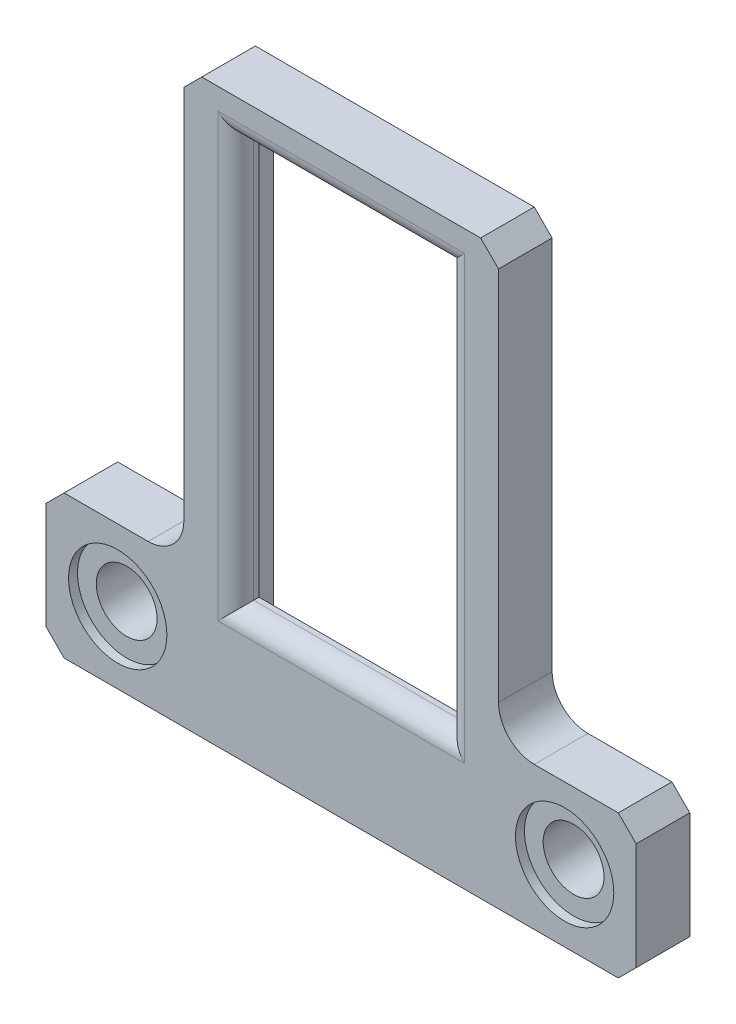
ISO-10303-21;
HEADER;
FILE_DESCRIPTION(('STEP AP214'),'2;1');
FILE_NAME('part.step','',(''),(''),'','','');
FILE_SCHEMA(('AUTOMOTIVE_DESIGN { 1 0 10303 214 1 1 1 1 }'));
ENDSEC;
DATA;
#1=APPLICATION_CONTEXT('core data for automotive mechanical design processes');
#2=APPLICATION_PROTOCOL_DEFINITION('international standard','automotive_design',2000,#1);
#3=PRODUCT_CONTEXT('',#1,'mechanical');
#4=PRODUCT('Part','Part','',(#3));
#5=PRODUCT_RELATED_PRODUCT_CATEGORY('part','',(#4));
#6=PRODUCT_DEFINITION_FORMATION('','',#4);
#7=PRODUCT_DEFINITION_CONTEXT('part definition',#1,'design');
#8=PRODUCT_DEFINITION('design','',#6,#7);
#9=PRODUCT_DEFINITION_SHAPE('','',#8);
#10=(LENGTH_UNIT() NAMED_UNIT(*) SI_UNIT(.MILLI.,.METRE.));
#11=(NAMED_UNIT(*) PLANE_ANGLE_UNIT() SI_UNIT($,.RADIAN.));
#12=(NAMED_UNIT(*) SI_UNIT($,.STERADIAN.) SOLID_ANGLE_UNIT());
#13=UNCERTAINTY_MEASURE_WITH_UNIT(LENGTH_MEASURE(1.E-05),#10,'distance_accuracy_value','');
#14=(GEOMETRIC_REPRESENTATION_CONTEXT(3) GLOBAL_UNCERTAINTY_ASSIGNED_CONTEXT((#13)) GLOBAL_UNIT_ASSIGNED_CONTEXT((#10,
#11,#12)) REPRESENTATION_CONTEXT('',''));
#15=CARTESIAN_POINT('',(0.,0.,0.));
#16=DIRECTION('',(0.,0.,1.));
#17=DIRECTION('',(1.,0.,0.));
#18=AXIS2_PLACEMENT_3D('',#15,#16,#17);
#19=CARTESIAN_POINT('',(0.,0.,3.));
#20=DIRECTION('',(1.,0.,0.));
#21=DIRECTION('',(0.,1.,0.));
#22=AXIS2_PLACEMENT_3D('',#19,#20,#21);
#23=PLANE('',#22);
#24=DIRECTION('',(0.,-1.,0.));
#25=VECTOR('',#24,1.);
#26=CARTESIAN_POINT('',(0.,0.,0.));
#27=LINE('',#26,#25);
#28=CARTESIAN_POINT('',(0.,-1.00000000000001,0.));
#29=VERTEX_POINT('',#28);
#30=CARTESIAN_POINT('',(0.,-22.,0.));
#31=VERTEX_POINT('',#30);
#32=EDGE_CURVE('E399',#29,#31,#27,.T.);
#33=ORIENTED_EDGE('',*,*,#32,.T.);
#34=DIRECTION('',(0.,0.,-1.));
#35=VECTOR('',#34,1.);
#36=CARTESIAN_POINT('',(0.,-22.,3.));
#37=LINE('',#36,#35);
#38=CARTESIAN_POINT('',(0.,-22.,3.));
#39=VERTEX_POINT('',#38);
#40=EDGE_CURVE('E315',#31,#39,#37,.F.);
#41=ORIENTED_EDGE('',*,*,#40,.T.);
#42=DIRECTION('',(0.,-1.,0.));
#43=VECTOR('',#42,1.);
#44=CARTESIAN_POINT('',(0.,0.,3.));
#45=LINE('',#44,#43);
#46=CARTESIAN_POINT('',(0.,-1.00000000000001,3.));
#47=VERTEX_POINT('',#46);
#48=EDGE_CURVE('E406',#47,#39,#45,.T.);
#49=ORIENTED_EDGE('',*,*,#48,.F.);
#50=DIRECTION('',(0.,0.,-1.));
#51=VECTOR('',#50,1.);
#52=CARTESIAN_POINT('',(0.,-1.00000000000001,3.));
#53=LINE('',#52,#51);
#54=EDGE_CURVE('E304',#47,#29,#53,.T.);
#55=ORIENTED_EDGE('',*,*,#54,.T.);
#56=EDGE_LOOP('',(#33,#41,#49,#55));
#57=FACE_BOUND('',#56,.T.);
#58=ADVANCED_FACE('F37',(#57),#23,.F.);
#59=CARTESIAN_POINT('',(0.,-24.,3.));
#60=DIRECTION('',(0.,-1.,0.));
#61=DIRECTION('',(0.,0.,-1.));
#62=AXIS2_PLACEMENT_3D('',#59,#60,#61);
#63=PLANE('',#62);
#64=DIRECTION('',(-1.,0.,0.));
#65=VECTOR('',#64,1.);
#66=CARTESIAN_POINT('',(0.,-24.,3.));
#67=LINE('',#66,#65);
#68=CARTESIAN_POINT('',(-2.,-24.,3.));
#69=VERTEX_POINT('',#68);
#70=CARTESIAN_POINT('',(-6.69999999999999,-24.,3.));
#71=VERTEX_POINT('',#70);
#72=EDGE_CURVE('E409',#69,#71,#67,.T.);
#73=ORIENTED_EDGE('',*,*,#72,.F.);
#74=DIRECTION('',(0.,0.,-1.));
#75=VECTOR('',#74,1.);
#76=CARTESIAN_POINT('',(-2.,-24.,0.));
#77=LINE('',#76,#75);
#78=CARTESIAN_POINT('',(-2.,-24.,0.));
#79=VERTEX_POINT('',#78);
#80=EDGE_CURVE('E312',#69,#79,#77,.T.);
#81=ORIENTED_EDGE('',*,*,#80,.T.);
#82=DIRECTION('',(-1.,0.,0.));
#83=VECTOR('',#82,1.);
#84=CARTESIAN_POINT('',(0.,-24.,0.));
#85=LINE('',#84,#83);
#86=CARTESIAN_POINT('',(-6.69999999999999,-24.,0.));
#87=VERTEX_POINT('',#86);
#88=EDGE_CURVE('E430',#79,#87,#85,.T.);
#89=ORIENTED_EDGE('',*,*,#88,.T.);
#90=DIRECTION('',(0.,0.,1.));
#91=VECTOR('',#90,1.);
#92=CARTESIAN_POINT('',(-6.69999999999999,-24.,3.));
#93=LINE('',#92,#91);
#94=EDGE_CURVE('E268',#87,#71,#93,.T.);
#95=ORIENTED_EDGE('',*,*,#94,.T.);
#96=EDGE_LOOP('',(#73,#81,#89,#95));
#97=FACE_BOUND('',#96,.T.);
#98=ADVANCED_FACE('F466',(#97),#63,.F.);
#99=CARTESIAN_POINT('',(-7.69999999999999,-32.,3.));
#100=DIRECTION('',(1.,0.,0.));
#101=DIRECTION('',(0.,0.,-1.));
#102=AXIS2_PLACEMENT_3D('',#99,#100,#101);
#103=PLANE('',#102);
#104=DIRECTION('',(0.,-1.,0.));
#105=VECTOR('',#104,1.);
#106=CARTESIAN_POINT('',(-7.69999999999999,-32.,3.));
#107=LINE('',#106,#105);
#108=CARTESIAN_POINT('',(-7.69999999999999,-25.,3.));
#109=VERTEX_POINT('',#108);
#110=CARTESIAN_POINT('',(-7.69999999999999,-31.,3.));
#111=VERTEX_POINT('',#110);
#112=EDGE_CURVE('E412',#109,#111,#107,.T.);
#113=ORIENTED_EDGE('',*,*,#112,.F.);
#114=DIRECTION('',(0.,0.,-1.));
#115=VECTOR('',#114,1.);
#116=CARTESIAN_POINT('',(-7.69999999999999,-25.,3.));
#117=LINE('',#116,#115);
#118=CARTESIAN_POINT('',(-7.69999999999999,-25.,0.));
#119=VERTEX_POINT('',#118);
#120=EDGE_CURVE('E239',#109,#119,#117,.T.);
#121=ORIENTED_EDGE('',*,*,#120,.T.);
#122=DIRECTION('',(0.,-1.,0.));
#123=VECTOR('',#122,1.);
#124=CARTESIAN_POINT('',(-7.69999999999999,-32.,0.));
#125=LINE('',#124,#123);
#126=CARTESIAN_POINT('',(-7.69999999999999,-31.,0.));
#127=VERTEX_POINT('',#126);
#128=EDGE_CURVE('E432',#119,#127,#125,.T.);
#129=ORIENTED_EDGE('',*,*,#128,.T.);
#130=DIRECTION('',(0.,0.,1.));
#131=VECTOR('',#130,1.);
#132=CARTESIAN_POINT('',(-7.69999999999999,-31.,3.));
#133=LINE('',#132,#131);
#134=EDGE_CURVE('E237',#127,#111,#133,.T.);
#135=ORIENTED_EDGE('',*,*,#134,.T.);
#136=EDGE_LOOP('',(#113,#121,#129,#135));
#137=FACE_BOUND('',#136,.T.);
#138=ADVANCED_FACE('F472',(#137),#103,.F.);
#139=CARTESIAN_POINT('',(-7.69999999999999,-32.,3.));
#140=DIRECTION('',(0.,1.,0.));
#141=DIRECTION('',(0.,0.,1.));
#142=AXIS2_PLACEMENT_3D('',#139,#140,#141);
#143=PLANE('',#142);
#144=DIRECTION('',(1.,0.,0.));
#145=VECTOR('',#144,1.);
#146=CARTESIAN_POINT('',(-7.69999999999999,-32.,3.));
#147=LINE('',#146,#145);
#148=CARTESIAN_POINT('',(-6.69999999999999,-32.,3.));
#149=VERTEX_POINT('',#148);
#150=CARTESIAN_POINT('',(24.3,-32.,3.));
#151=VERTEX_POINT('',#150);
#152=EDGE_CURVE('E415',#149,#151,#147,.T.);
#153=ORIENTED_EDGE('',*,*,#152,.F.);
#154=DIRECTION('',(0.,0.,-1.));
#155=VECTOR('',#154,1.);
#156=CARTESIAN_POINT('',(-6.69999999999999,-32.,3.));
#157=LINE('',#156,#155);
#158=CARTESIAN_POINT('',(-6.69999999999999,-32.,0.));
#159=VERTEX_POINT('',#158);
#160=EDGE_CURVE('E285',#149,#159,#157,.T.);
#161=ORIENTED_EDGE('',*,*,#160,.T.);
#162=DIRECTION('',(1.,0.,0.));
#163=VECTOR('',#162,1.);
#164=CARTESIAN_POINT('',(-7.69999999999999,-32.,0.));
#165=LINE('',#164,#163);
#166=CARTESIAN_POINT('',(24.3,-32.,0.));
#167=VERTEX_POINT('',#166);
#168=EDGE_CURVE('E435',#159,#167,#165,.T.);
#169=ORIENTED_EDGE('',*,*,#168,.T.);
#170=DIRECTION('',(0.,0.,1.));
#171=VECTOR('',#170,1.);
#172=CARTESIAN_POINT('',(24.3,-32.,3.));
#173=LINE('',#172,#171);
#174=EDGE_CURVE('E283',#167,#151,#173,.T.);
#175=ORIENTED_EDGE('',*,*,#174,.T.);
#176=EDGE_LOOP('',(#153,#161,#169,#175));
#177=FACE_BOUND('',#176,.T.);
#178=ADVANCED_FACE('F550',(#177),#143,.F.);
#179=CARTESIAN_POINT('',(25.3,-32.,3.));
#180=DIRECTION('',(-1.,0.,0.));
#181=DIRECTION('',(0.,0.,1.));
#182=AXIS2_PLACEMENT_3D('',#179,#180,#181);
#183=PLANE('',#182);
#184=DIRECTION('',(0.,1.,0.));
#185=VECTOR('',#184,1.);
#186=CARTESIAN_POINT('',(25.3,-32.,3.));
#187=LINE('',#186,#185);
#188=CARTESIAN_POINT('',(25.3,-31.,3.));
#189=VERTEX_POINT('',#188);
#190=CARTESIAN_POINT('',(25.3,-25.,3.));
#191=VERTEX_POINT('',#190);
#192=EDGE_CURVE('E418',#189,#191,#187,.T.);
#193=ORIENTED_EDGE('',*,*,#192,.F.);
#194=DIRECTION('',(0.,0.,-1.));
#195=VECTOR('',#194,1.);
#196=CARTESIAN_POINT('',(25.3,-31.,3.));
#197=LINE('',#196,#195);
#198=CARTESIAN_POINT('',(25.3,-31.,0.));
#199=VERTEX_POINT('',#198);
#200=EDGE_CURVE('E290',#189,#199,#197,.T.);
#201=ORIENTED_EDGE('',*,*,#200,.T.);
#202=DIRECTION('',(0.,1.,0.));
#203=VECTOR('',#202,1.);
#204=CARTESIAN_POINT('',(25.3,-32.,0.));
#205=LINE('',#204,#203);
#206=CARTESIAN_POINT('',(25.3,-25.,0.));
#207=VERTEX_POINT('',#206);
#208=EDGE_CURVE('E438',#199,#207,#205,.T.);
#209=ORIENTED_EDGE('',*,*,#208,.T.);
#210=DIRECTION('',(0.,0.,1.));
#211=VECTOR('',#210,1.);
#212=CARTESIAN_POINT('',(25.3,-25.,3.));
#213=LINE('',#212,#211);
#214=EDGE_CURVE('E288',#207,#191,#213,.T.);
#215=ORIENTED_EDGE('',*,*,#214,.T.);
#216=EDGE_LOOP('',(#193,#201,#209,#215));
#217=FACE_BOUND('',#216,.T.);
#218=ADVANCED_FACE('F557',(#217),#183,.F.);
#219=CARTESIAN_POINT('',(17.6,-24.,3.));
#220=DIRECTION('',(0.,-1.,0.));
#221=DIRECTION('',(0.,0.,-1.));
#222=AXIS2_PLACEMENT_3D('',#219,#220,#221);
#223=PLANE('',#222);
#224=DIRECTION('',(-1.,0.,0.));
#225=VECTOR('',#224,1.);
#226=CARTESIAN_POINT('',(17.6,-24.,0.));
#227=LINE('',#226,#225);
#228=CARTESIAN_POINT('',(24.3,-24.,0.));
#229=VERTEX_POINT('',#228);
#230=CARTESIAN_POINT('',(19.6,-24.,0.));
#231=VERTEX_POINT('',#230);
#232=EDGE_CURVE('E441',#229,#231,#227,.T.);
#233=ORIENTED_EDGE('',*,*,#232,.T.);
#234=DIRECTION('',(0.,0.,-1.));
#235=VECTOR('',#234,1.);
#236=CARTESIAN_POINT('',(19.6,-24.,3.));
#237=LINE('',#236,#235);
#238=CARTESIAN_POINT('',(19.6,-24.,3.));
#239=VERTEX_POINT('',#238);
#240=EDGE_CURVE('E310',#231,#239,#237,.F.);
#241=ORIENTED_EDGE('',*,*,#240,.T.);
#242=DIRECTION('',(-1.,0.,0.));
#243=VECTOR('',#242,1.);
#244=CARTESIAN_POINT('',(17.6,-24.,3.));
#245=LINE('',#244,#243);
#246=CARTESIAN_POINT('',(24.3,-24.,3.));
#247=VERTEX_POINT('',#246);
#248=EDGE_CURVE('E421',#247,#239,#245,.T.);
#249=ORIENTED_EDGE('',*,*,#248,.F.);
#250=DIRECTION('',(0.,0.,-1.));
#251=VECTOR('',#250,1.);
#252=CARTESIAN_POINT('',(24.3,-24.,3.));
#253=LINE('',#252,#251);
#254=EDGE_CURVE('E293',#247,#229,#253,.T.);
#255=ORIENTED_EDGE('',*,*,#254,.T.);
#256=EDGE_LOOP('',(#233,#241,#249,#255));
#257=FACE_BOUND('',#256,.T.);
#258=ADVANCED_FACE('F564',(#257),#223,.F.);
#259=CARTESIAN_POINT('',(17.6,0.,3.));
#260=DIRECTION('',(-1.,0.,0.));
#261=DIRECTION('',(0.,-1.,0.));
#262=AXIS2_PLACEMENT_3D('',#259,#260,#261);
#263=PLANE('',#262);
#264=DIRECTION('',(0.,1.,0.));
#265=VECTOR('',#264,1.);
#266=CARTESIAN_POINT('',(17.6,0.,3.));
#267=LINE('',#266,#265);
#268=CARTESIAN_POINT('',(17.6,-22.,3.));
#269=VERTEX_POINT('',#268);
#270=CARTESIAN_POINT('',(17.6,-1.00000000000001,3.));
#271=VERTEX_POINT('',#270);
#272=EDGE_CURVE('E424',#269,#271,#267,.T.);
#273=ORIENTED_EDGE('',*,*,#272,.F.);
#274=DIRECTION('',(0.,0.,-1.));
#275=VECTOR('',#274,1.);
#276=CARTESIAN_POINT('',(17.6,-22.,0.));
#277=LINE('',#276,#275);
#278=CARTESIAN_POINT('',(17.6,-22.,0.));
#279=VERTEX_POINT('',#278);
#280=EDGE_CURVE('E307',#269,#279,#277,.T.);
#281=ORIENTED_EDGE('',*,*,#280,.T.);
#282=DIRECTION('',(0.,1.,0.));
#283=VECTOR('',#282,1.);
#284=CARTESIAN_POINT('',(17.6,0.,0.));
#285=LINE('',#284,#283);
#286=CARTESIAN_POINT('',(17.6,-1.00000000000001,0.));
#287=VERTEX_POINT('',#286);
#288=EDGE_CURVE('E444',#279,#287,#285,.T.);
#289=ORIENTED_EDGE('',*,*,#288,.T.);
#290=DIRECTION('',(0.,0.,1.));
#291=VECTOR('',#290,1.);
#292=CARTESIAN_POINT('',(17.6,-1.00000000000001,3.));
#293=LINE('',#292,#291);
#294=EDGE_CURVE('E301',#287,#271,#293,.T.);
#295=ORIENTED_EDGE('',*,*,#294,.T.);
#296=EDGE_LOOP('',(#273,#281,#289,#295));
#297=FACE_BOUND('',#296,.T.);
#298=ADVANCED_FACE('F570',(#297),#263,.F.);
#299=CARTESIAN_POINT('',(0.,0.,3.));
#300=DIRECTION('',(0.,-1.,0.));
#301=DIRECTION('',(0.,0.,-1.));
#302=AXIS2_PLACEMENT_3D('',#299,#300,#301);
#303=PLANE('',#302);
#304=DIRECTION('',(-1.,0.,0.));
#305=VECTOR('',#304,1.);
#306=CARTESIAN_POINT('',(0.,0.,3.));
#307=LINE('',#306,#305);
#308=CARTESIAN_POINT('',(16.6,0.,3.));
#309=VERTEX_POINT('',#308);
#310=CARTESIAN_POINT('',(1.00000000000001,0.,3.));
#311=VERTEX_POINT('',#310);
#312=EDGE_CURVE('E225',#309,#311,#307,.T.);
#313=ORIENTED_EDGE('',*,*,#312,.F.);
#314=DIRECTION('',(0.,0.,-1.));
#315=VECTOR('',#314,1.);
#316=CARTESIAN_POINT('',(16.6,0.,3.));
#317=LINE('',#316,#315);
#318=CARTESIAN_POINT('',(16.6,0.,0.));
#319=VERTEX_POINT('',#318);
#320=EDGE_CURVE('E298',#309,#319,#317,.T.);
#321=ORIENTED_EDGE('',*,*,#320,.T.);
#322=DIRECTION('',(-1.,0.,0.));
#323=VECTOR('',#322,1.);
#324=CARTESIAN_POINT('',(0.,0.,0.));
#325=LINE('',#324,#323);
#326=CARTESIAN_POINT('',(1.00000000000001,0.,0.));
#327=VERTEX_POINT('',#326);
#328=EDGE_CURVE('E410',#319,#327,#325,.T.);
#329=ORIENTED_EDGE('',*,*,#328,.T.);
#330=DIRECTION('',(0.,0.,1.));
#331=VECTOR('',#330,1.);
#332=CARTESIAN_POINT('',(1.00000000000001,0.,3.));
#333=LINE('',#332,#331);
#334=EDGE_CURVE('E296',#327,#311,#333,.T.);
#335=ORIENTED_EDGE('',*,*,#334,.T.);
#336=EDGE_LOOP('',(#313,#321,#329,#335));
#337=FACE_BOUND('',#336,.T.);
#338=ADVANCED_FACE('F578',(#337),#303,.F.);
#339=CARTESIAN_POINT('',(0.,0.,3.));
#340=DIRECTION('',(0.,0.,-1.));
#341=DIRECTION('',(-1.,0.,0.));
#342=AXIS2_PLACEMENT_3D('',#339,#340,#341);
#343=PLANE('',#342);
#344=DIRECTION('',(0.,1.,0.));
#345=VECTOR('',#344,1.);
#346=CARTESIAN_POINT('',(15.7,0.,3.));
#347=LINE('',#346,#345);
#348=CARTESIAN_POINT('',(15.7,-1.2,3.));
#349=VERTEX_POINT('',#348);
#350=CARTESIAN_POINT('',(15.7,-25.9,3.));
#351=VERTEX_POINT('',#350);
#352=EDGE_CURVE('E331',#349,#351,#347,.F.);
#353=ORIENTED_EDGE('',*,*,#352,.T.);
#354=DIRECTION('',(1.,0.,0.));
#355=VECTOR('',#354,1.);
#356=CARTESIAN_POINT('',(0.,-25.9,3.));
#357=LINE('',#356,#355);
#358=CARTESIAN_POINT('',(1.90000000000001,-25.9,3.));
#359=VERTEX_POINT('',#358);
#360=EDGE_CURVE('E333',#351,#359,#357,.F.);
#361=ORIENTED_EDGE('',*,*,#360,.T.);
#362=DIRECTION('',(0.,-1.,0.));
#363=VECTOR('',#362,1.);
#364=CARTESIAN_POINT('',(1.9,0.,3.));
#365=LINE('',#364,#363);
#366=CARTESIAN_POINT('',(1.9,-1.2,3.));
#367=VERTEX_POINT('',#366);
#368=EDGE_CURVE('E329',#359,#367,#365,.F.);
#369=ORIENTED_EDGE('',*,*,#368,.T.);
#370=DIRECTION('',(-1.,0.,0.));
#371=VECTOR('',#370,1.);
#372=CARTESIAN_POINT('',(0.,-1.2,3.));
#373=LINE('',#372,#371);
#374=EDGE_CURVE('E327',#367,#349,#373,.F.);
#375=ORIENTED_EDGE('',*,*,#374,.T.);
#376=EDGE_LOOP('',(#353,#361,#369,#375));
#377=FACE_BOUND('',#376,.T.);
#378=CARTESIAN_POINT('',(-3.7,-28.,3.));
#379=DIRECTION('',(0.,0.,1.));
#380=DIRECTION('',(1.,0.,0.));
#381=AXIS2_PLACEMENT_3D('',#378,#379,#380);
#382=CIRCLE('',#381,2.75);
#383=CARTESIAN_POINT('',(-0.949999999999999,-28.,3.));
#384=VERTEX_POINT('',#383);
#385=EDGE_CURVE('E347',#384,#384,#382,.T.);
#386=ORIENTED_EDGE('',*,*,#385,.F.);
#387=EDGE_LOOP('',(#386));
#388=FACE_BOUND('',#387,.T.);
#389=CARTESIAN_POINT('',(21.3,-28.,3.));
#390=DIRECTION('',(0.,0.,1.));
#391=DIRECTION('',(1.,0.,0.));
#392=AXIS2_PLACEMENT_3D('',#389,#390,#391);
#393=CIRCLE('',#392,2.75);
#394=CARTESIAN_POINT('',(24.05,-28.,3.));
#395=VERTEX_POINT('',#394);
#396=EDGE_CURVE('E249',#395,#395,#393,.T.);
#397=ORIENTED_EDGE('',*,*,#396,.F.);
#398=EDGE_LOOP('',(#397));
#399=FACE_BOUND('',#398,.T.);
#400=ORIENTED_EDGE('',*,*,#48,.T.);
#401=CARTESIAN_POINT('',(-2.,-22.,3.));
#402=DIRECTION('',(0.,0.,-1.));
#403=DIRECTION('',(-1.,0.,0.));
#404=AXIS2_PLACEMENT_3D('',#401,#402,#403);
#405=CIRCLE('',#404,2.);
#406=EDGE_CURVE('E323',#39,#69,#405,.T.);
#407=ORIENTED_EDGE('',*,*,#406,.T.);
#408=ORIENTED_EDGE('',*,*,#72,.T.);
#409=DIRECTION('',(0.70710678118655,0.707106781186545,0.));
#410=VECTOR('',#409,1.);
#411=CARTESIAN_POINT('',(-7.69999999999999,-25.,3.));
#412=LINE('',#411,#410);
#413=EDGE_CURVE('E281',#71,#109,#412,.F.);
#414=ORIENTED_EDGE('',*,*,#413,.T.);
#415=ORIENTED_EDGE('',*,*,#112,.T.);
#416=DIRECTION('',(-0.707106781186545,0.70710678118655,0.));
#417=VECTOR('',#416,1.);
#418=CARTESIAN_POINT('',(-6.69999999999999,-32.,3.));
#419=LINE('',#418,#417);
#420=EDGE_CURVE('E279',#111,#149,#419,.F.);
#421=ORIENTED_EDGE('',*,*,#420,.T.);
#422=ORIENTED_EDGE('',*,*,#152,.T.);
#423=DIRECTION('',(-0.70710678118655,-0.707106781186545,0.));
#424=VECTOR('',#423,1.);
#425=CARTESIAN_POINT('',(25.3,-31.,3.));
#426=LINE('',#425,#424);
#427=EDGE_CURVE('E277',#151,#189,#426,.F.);
#428=ORIENTED_EDGE('',*,*,#427,.T.);
#429=ORIENTED_EDGE('',*,*,#192,.T.);
#430=DIRECTION('',(0.707106781186545,-0.70710678118655,0.));
#431=VECTOR('',#430,1.);
#432=CARTESIAN_POINT('',(24.3,-24.,3.));
#433=LINE('',#432,#431);
#434=EDGE_CURVE('E275',#191,#247,#433,.F.);
#435=ORIENTED_EDGE('',*,*,#434,.T.);
#436=ORIENTED_EDGE('',*,*,#248,.T.);
#437=CARTESIAN_POINT('',(19.6,-22.,3.));
#438=DIRECTION('',(0.,0.,-1.));
#439=DIRECTION('',(-1.,0.,0.));
#440=AXIS2_PLACEMENT_3D('',#437,#438,#439);
#441=CIRCLE('',#440,2.);
#442=EDGE_CURVE('E319',#239,#269,#441,.T.);
#443=ORIENTED_EDGE('',*,*,#442,.T.);
#444=ORIENTED_EDGE('',*,*,#272,.T.);
#445=DIRECTION('',(0.707106781186548,-0.707106781186548,0.));
#446=VECTOR('',#445,1.);
#447=CARTESIAN_POINT('',(16.6,0.,3.));
#448=LINE('',#447,#446);
#449=EDGE_CURVE('E273',#271,#309,#448,.F.);
#450=ORIENTED_EDGE('',*,*,#449,.T.);
#451=ORIENTED_EDGE('',*,*,#312,.T.);
#452=DIRECTION('',(0.707106781186548,0.707106781186548,0.));
#453=VECTOR('',#452,1.);
#454=CARTESIAN_POINT('',(0.,-1.00000000000001,3.));
#455=LINE('',#454,#453);
#456=EDGE_CURVE('E271',#311,#47,#455,.F.);
#457=ORIENTED_EDGE('',*,*,#456,.T.);
#458=EDGE_LOOP('',(#400,#407,#408,#414,#415,#421,#422,#428,#429,#435,#436,#443,#444,#450,#451,#457));
#459=FACE_BOUND('',#458,.T.);
#460=ADVANCED_FACE('F535',(#377,#388,#399,#459),#343,.F.);
#461=CARTESIAN_POINT('',(0.,0.,0.));
#462=DIRECTION('',(0.,0.,-1.));
#463=DIRECTION('',(-1.,0.,0.));
#464=AXIS2_PLACEMENT_3D('',#461,#462,#463);
#465=PLANE('',#464);
#466=CARTESIAN_POINT('',(-3.7,-28.,0.));
#467=DIRECTION('',(0.,0.,-1.));
#468=DIRECTION('',(-1.,0.,0.));
#469=AXIS2_PLACEMENT_3D('',#466,#467,#468);
#470=CIRCLE('',#469,1.7);
#471=CARTESIAN_POINT('',(-5.4,-28.,0.));
#472=VERTEX_POINT('',#471);
#473=EDGE_CURVE('E247',#472,#472,#470,.T.);
#474=ORIENTED_EDGE('',*,*,#473,.F.);
#475=EDGE_LOOP('',(#474));
#476=FACE_BOUND('',#475,.T.);
#477=CARTESIAN_POINT('',(21.3,-28.,0.));
#478=DIRECTION('',(0.,0.,-1.));
#479=DIRECTION('',(-1.,0.,0.));
#480=AXIS2_PLACEMENT_3D('',#477,#478,#479);
#481=CIRCLE('',#480,1.7);
#482=CARTESIAN_POINT('',(19.6,-28.,0.));
#483=VERTEX_POINT('',#482);
#484=EDGE_CURVE('E231',#483,#483,#481,.T.);
#485=ORIENTED_EDGE('',*,*,#484,.F.);
#486=EDGE_LOOP('',(#485));
#487=FACE_BOUND('',#486,.T.);
#488=DIRECTION('',(-1.,0.,0.));
#489=VECTOR('',#488,1.);
#490=CARTESIAN_POINT('',(2.,-30.,0.));
#491=LINE('',#490,#489);
#492=CARTESIAN_POINT('',(15.6,-30.,0.));
#493=VERTEX_POINT('',#492);
#494=CARTESIAN_POINT('',(2.,-30.,0.));
#495=VERTEX_POINT('',#494);
#496=EDGE_CURVE('E370',#493,#495,#491,.T.);
#497=ORIENTED_EDGE('',*,*,#496,.F.);
#498=DIRECTION('',(0.,-1.,0.));
#499=VECTOR('',#498,1.);
#500=CARTESIAN_POINT('',(15.6,-1.,0.));
#501=LINE('',#500,#499);
#502=CARTESIAN_POINT('',(15.6,-1.,0.));
#503=VERTEX_POINT('',#502);
#504=EDGE_CURVE('E378',#503,#493,#501,.T.);
#505=ORIENTED_EDGE('',*,*,#504,.F.);
#506=DIRECTION('',(1.,0.,0.));
#507=VECTOR('',#506,1.);
#508=CARTESIAN_POINT('',(2.,-1.,0.));
#509=LINE('',#508,#507);
#510=CARTESIAN_POINT('',(2.,-1.,0.));
#511=VERTEX_POINT('',#510);
#512=EDGE_CURVE('E392',#511,#503,#509,.T.);
#513=ORIENTED_EDGE('',*,*,#512,.F.);
#514=DIRECTION('',(0.,1.,0.));
#515=VECTOR('',#514,1.);
#516=CARTESIAN_POINT('',(2.,-1.,0.));
#517=LINE('',#516,#515);
#518=EDGE_CURVE('E389',#495,#511,#517,.T.);
#519=ORIENTED_EDGE('',*,*,#518,.F.);
#520=EDGE_LOOP('',(#497,#505,#513,#519));
#521=FACE_BOUND('',#520,.T.);
#522=ORIENTED_EDGE('',*,*,#128,.F.);
#523=DIRECTION('',(-0.70710678118655,-0.707106781186545,0.));
#524=VECTOR('',#523,1.);
#525=CARTESIAN_POINT('',(8.65000000000003,-8.65000000000009,0.));
#526=LINE('',#525,#524);
#527=EDGE_CURVE('E265',#119,#87,#526,.F.);
#528=ORIENTED_EDGE('',*,*,#527,.T.);
#529=ORIENTED_EDGE('',*,*,#88,.F.);
#530=CARTESIAN_POINT('',(-2.,-22.,0.));
#531=DIRECTION('',(0.,0.,-1.));
#532=DIRECTION('',(-1.,0.,0.));
#533=AXIS2_PLACEMENT_3D('',#530,#531,#532);
#534=CIRCLE('',#533,2.);
#535=EDGE_CURVE('E321',#79,#31,#534,.F.);
#536=ORIENTED_EDGE('',*,*,#535,.T.);
#537=ORIENTED_EDGE('',*,*,#32,.F.);
#538=DIRECTION('',(-0.707106781186548,-0.707106781186548,0.));
#539=VECTOR('',#538,1.);
#540=CARTESIAN_POINT('',(0.500000000000004,-0.500000000000004,0.));
#541=LINE('',#540,#539);
#542=EDGE_CURVE('E254',#29,#327,#541,.F.);
#543=ORIENTED_EDGE('',*,*,#542,.T.);
#544=ORIENTED_EDGE('',*,*,#328,.F.);
#545=DIRECTION('',(-0.707106781186548,0.707106781186548,0.));
#546=VECTOR('',#545,1.);
#547=CARTESIAN_POINT('',(8.3,8.3,0.));
#548=LINE('',#547,#546);
#549=EDGE_CURVE('E256',#319,#287,#548,.F.);
#550=ORIENTED_EDGE('',*,*,#549,.T.);
#551=ORIENTED_EDGE('',*,*,#288,.F.);
#552=CARTESIAN_POINT('',(19.6,-22.,0.));
#553=DIRECTION('',(0.,0.,-1.));
#554=DIRECTION('',(-1.,0.,0.));
#555=AXIS2_PLACEMENT_3D('',#552,#553,#554);
#556=CIRCLE('',#555,2.);
#557=EDGE_CURVE('E317',#279,#231,#556,.F.);
#558=ORIENTED_EDGE('',*,*,#557,.T.);
#559=ORIENTED_EDGE('',*,*,#232,.F.);
#560=DIRECTION('',(-0.707106781186545,0.70710678118655,0.));
#561=VECTOR('',#560,1.);
#562=CARTESIAN_POINT('',(0.150000000000085,0.150000000000084,0.));
#563=LINE('',#562,#561);
#564=EDGE_CURVE('E259',#229,#207,#563,.F.);
#565=ORIENTED_EDGE('',*,*,#564,.T.);
#566=ORIENTED_EDGE('',*,*,#208,.F.);
#567=DIRECTION('',(0.70710678118655,0.707106781186545,0.));
#568=VECTOR('',#567,1.);
#569=CARTESIAN_POINT('',(28.1499999999999,-28.1500000000001,0.));
#570=LINE('',#569,#568);
#571=EDGE_CURVE('E261',#199,#167,#570,.F.);
#572=ORIENTED_EDGE('',*,*,#571,.T.);
#573=ORIENTED_EDGE('',*,*,#168,.F.);
#574=DIRECTION('',(0.707106781186545,-0.70710678118655,0.));
#575=VECTOR('',#574,1.);
#576=CARTESIAN_POINT('',(-19.35,-19.3499999999999,0.));
#577=LINE('',#576,#575);
#578=EDGE_CURVE('E263',#159,#127,#577,.F.);
#579=ORIENTED_EDGE('',*,*,#578,.T.);
#580=EDGE_LOOP('',(#522,#528,#529,#536,#537,#543,#544,#550,#551,#558,#559,#565,#566,#572,#573,#579));
#581=FACE_BOUND('',#580,.T.);
#582=ADVANCED_FACE('F584',(#476,#487,#521,#581),#465,.T.);
#583=CARTESIAN_POINT('',(2.,-30.,1.7));
#584=DIRECTION('',(0.,-1.,0.));
#585=DIRECTION('',(1.,0.,0.));
#586=AXIS2_PLACEMENT_3D('',#583,#584,#585);
#587=PLANE('',#586);
#588=ORIENTED_EDGE('',*,*,#496,.T.);
#589=DIRECTION('',(0.,0.,-1.));
#590=VECTOR('',#589,1.);
#591=CARTESIAN_POINT('',(2.,-30.,1.7));
#592=LINE('',#591,#590);
#593=CARTESIAN_POINT('',(2.,-30.,1.7));
#594=VERTEX_POINT('',#593);
#595=EDGE_CURVE('E387',#594,#495,#592,.T.);
#596=ORIENTED_EDGE('',*,*,#595,.F.);
#597=DIRECTION('',(-1.,0.,0.));
#598=VECTOR('',#597,1.);
#599=CARTESIAN_POINT('',(2.,-30.,1.7));
#600=LINE('',#599,#598);
#601=CARTESIAN_POINT('',(15.6,-30.,1.7));
#602=VERTEX_POINT('',#601);
#603=EDGE_CURVE('E374',#602,#594,#600,.T.);
#604=ORIENTED_EDGE('',*,*,#603,.F.);
#605=DIRECTION('',(0.,0.,-1.));
#606=VECTOR('',#605,1.);
#607=CARTESIAN_POINT('',(15.6,-30.,1.7));
#608=LINE('',#607,#606);
#609=EDGE_CURVE('E397',#602,#493,#608,.T.);
#610=ORIENTED_EDGE('',*,*,#609,.T.);
#611=EDGE_LOOP('',(#588,#596,#604,#610));
#612=FACE_BOUND('',#611,.T.);
#613=ADVANCED_FACE('F586',(#612),#587,.F.);
#614=CARTESIAN_POINT('',(15.6,-1.,1.7));
#615=DIRECTION('',(1.,0.,0.));
#616=DIRECTION('',(0.,1.,0.));
#617=AXIS2_PLACEMENT_3D('',#614,#615,#616);
#618=PLANE('',#617);
#619=ORIENTED_EDGE('',*,*,#504,.T.);
#620=ORIENTED_EDGE('',*,*,#609,.F.);
#621=DIRECTION('',(0.,-1.,0.));
#622=VECTOR('',#621,1.);
#623=CARTESIAN_POINT('',(15.6,-1.,1.7));
#624=LINE('',#623,#622);
#625=CARTESIAN_POINT('',(15.6,-1.,1.7));
#626=VERTEX_POINT('',#625);
#627=EDGE_CURVE('E384',#626,#602,#624,.T.);
#628=ORIENTED_EDGE('',*,*,#627,.F.);
#629=DIRECTION('',(0.,0.,-1.));
#630=VECTOR('',#629,1.);
#631=CARTESIAN_POINT('',(15.6,-1.,1.7));
#632=LINE('',#631,#630);
#633=EDGE_CURVE('E400',#626,#503,#632,.T.);
#634=ORIENTED_EDGE('',*,*,#633,.T.);
#635=EDGE_LOOP('',(#619,#620,#628,#634));
#636=FACE_BOUND('',#635,.T.);
#637=ADVANCED_FACE('F593',(#636),#618,.F.);
#638=CARTESIAN_POINT('',(2.,-1.,1.7));
#639=DIRECTION('',(0.,1.,0.));
#640=DIRECTION('',(-1.,0.,0.));
#641=AXIS2_PLACEMENT_3D('',#638,#639,#640);
#642=PLANE('',#641);
#643=ORIENTED_EDGE('',*,*,#512,.T.);
#644=ORIENTED_EDGE('',*,*,#633,.F.);
#645=DIRECTION('',(1.,0.,0.));
#646=VECTOR('',#645,1.);
#647=CARTESIAN_POINT('',(2.,-1.,1.7));
#648=LINE('',#647,#646);
#649=CARTESIAN_POINT('',(2.,-1.,1.7));
#650=VERTEX_POINT('',#649);
#651=EDGE_CURVE('E381',#650,#626,#648,.T.);
#652=ORIENTED_EDGE('',*,*,#651,.F.);
#653=DIRECTION('',(0.,0.,-1.));
#654=VECTOR('',#653,1.);
#655=CARTESIAN_POINT('',(2.,-1.,1.7));
#656=LINE('',#655,#654);
#657=EDGE_CURVE('E402',#650,#511,#656,.T.);
#658=ORIENTED_EDGE('',*,*,#657,.T.);
#659=EDGE_LOOP('',(#643,#644,#652,#658));
#660=FACE_BOUND('',#659,.T.);
#661=ADVANCED_FACE('F805',(#660),#642,.F.);
#662=CARTESIAN_POINT('',(2.,-1.,1.7));
#663=DIRECTION('',(-1.,0.,0.));
#664=DIRECTION('',(0.,-1.,0.));
#665=AXIS2_PLACEMENT_3D('',#662,#663,#664);
#666=PLANE('',#665);
#667=ORIENTED_EDGE('',*,*,#518,.T.);
#668=ORIENTED_EDGE('',*,*,#657,.F.);
#669=DIRECTION('',(0.,1.,0.));
#670=VECTOR('',#669,1.);
#671=CARTESIAN_POINT('',(2.,-1.,1.7));
#672=LINE('',#671,#670);
#673=EDGE_CURVE('E377',#594,#650,#672,.T.);
#674=ORIENTED_EDGE('',*,*,#673,.F.);
#675=ORIENTED_EDGE('',*,*,#595,.T.);
#676=EDGE_LOOP('',(#667,#668,#674,#675));
#677=FACE_BOUND('',#676,.T.);
#678=ADVANCED_FACE('F796',(#677),#666,.F.);
#679=CARTESIAN_POINT('',(0.,0.,1.7));
#680=DIRECTION('',(0.,0.,-1.));
#681=DIRECTION('',(-1.,0.,0.));
#682=AXIS2_PLACEMENT_3D('',#679,#680,#681);
#683=PLANE('',#682);
#684=DIRECTION('',(0.,1.,0.));
#685=VECTOR('',#684,1.);
#686=CARTESIAN_POINT('',(2.9,0.,1.7));
#687=LINE('',#686,#685);
#688=CARTESIAN_POINT('',(2.90000000000001,-24.9,1.7));
#689=VERTEX_POINT('',#688);
#690=CARTESIAN_POINT('',(2.9,-2.2,1.7));
#691=VERTEX_POINT('',#690);
#692=EDGE_CURVE('E229',#689,#691,#687,.T.);
#693=ORIENTED_EDGE('',*,*,#692,.F.);
#694=DIRECTION('',(-1.,0.,0.));
#695=VECTOR('',#694,1.);
#696=CARTESIAN_POINT('',(0.,-24.9,1.7));
#697=LINE('',#696,#695);
#698=CARTESIAN_POINT('',(14.7,-24.9,1.7));
#699=VERTEX_POINT('',#698);
#700=EDGE_CURVE('E213',#699,#689,#697,.T.);
#701=ORIENTED_EDGE('',*,*,#700,.F.);
#702=DIRECTION('',(0.,-1.,0.));
#703=VECTOR('',#702,1.);
#704=CARTESIAN_POINT('',(14.7,0.,1.7));
#705=LINE('',#704,#703);
#706=CARTESIAN_POINT('',(14.7,-2.2,1.7));
#707=VERTEX_POINT('',#706);
#708=EDGE_CURVE('E224',#707,#699,#705,.T.);
#709=ORIENTED_EDGE('',*,*,#708,.F.);
#710=DIRECTION('',(1.,0.,0.));
#711=VECTOR('',#710,1.);
#712=CARTESIAN_POINT('',(0.,-2.2,1.7));
#713=LINE('',#712,#711);
#714=EDGE_CURVE('E236',#691,#707,#713,.T.);
#715=ORIENTED_EDGE('',*,*,#714,.F.);
#716=EDGE_LOOP('',(#693,#701,#709,#715));
#717=FACE_BOUND('',#716,.T.);
#718=ORIENTED_EDGE('',*,*,#603,.T.);
#719=ORIENTED_EDGE('',*,*,#673,.T.);
#720=ORIENTED_EDGE('',*,*,#651,.T.);
#721=ORIENTED_EDGE('',*,*,#627,.T.);
#722=EDGE_LOOP('',(#718,#719,#720,#721));
#723=FACE_BOUND('',#722,.T.);
#724=ADVANCED_FACE('F234',(#717,#723),#683,.T.);
#725=CARTESIAN_POINT('',(2.9,-2.2,0.));
#726=DIRECTION('',(-1.,0.,0.));
#727=DIRECTION('',(0.,-1.,0.));
#728=AXIS2_PLACEMENT_3D('',#725,#726,#727);
#729=PLANE('',#728);
#730=DIRECTION('',(0.,0.,1.));
#731=VECTOR('',#730,1.);
#732=CARTESIAN_POINT('',(2.9,-2.2,0.));
#733=LINE('',#732,#731);
#734=CARTESIAN_POINT('',(2.9,-2.2,2.));
#735=VERTEX_POINT('',#734);
#736=EDGE_CURVE('E368',#691,#735,#733,.T.);
#737=ORIENTED_EDGE('',*,*,#736,.T.);
#738=DIRECTION('',(0.,-1.,0.));
#739=VECTOR('',#738,1.);
#740=CARTESIAN_POINT('',(2.9,-2.2,2.));
#741=LINE('',#740,#739);
#742=CARTESIAN_POINT('',(2.90000000000001,-24.9,2.));
#743=VERTEX_POINT('',#742);
#744=EDGE_CURVE('E46',#735,#743,#741,.T.);
#745=ORIENTED_EDGE('',*,*,#744,.T.);
#746=DIRECTION('',(0.,0.,1.));
#747=VECTOR('',#746,1.);
#748=CARTESIAN_POINT('',(2.90000000000001,-24.9,0.));
#749=LINE('',#748,#747);
#750=EDGE_CURVE('E217',#689,#743,#749,.T.);
#751=ORIENTED_EDGE('',*,*,#750,.F.);
#752=ORIENTED_EDGE('',*,*,#692,.T.);
#753=EDGE_LOOP('',(#737,#745,#751,#752));
#754=FACE_BOUND('',#753,.T.);
#755=ADVANCED_FACE('F228',(#754),#729,.F.);
#756=CARTESIAN_POINT('',(2.9,-2.2,0.));
#757=DIRECTION('',(0.,1.,0.));
#758=DIRECTION('',(0.,0.,1.));
#759=AXIS2_PLACEMENT_3D('',#756,#757,#758);
#760=PLANE('',#759);
#761=DIRECTION('',(0.,0.,1.));
#762=VECTOR('',#761,1.);
#763=CARTESIAN_POINT('',(14.7,-2.2,0.));
#764=LINE('',#763,#762);
#765=CARTESIAN_POINT('',(14.7,-2.2,2.));
#766=VERTEX_POINT('',#765);
#767=EDGE_CURVE('E371',#707,#766,#764,.T.);
#768=ORIENTED_EDGE('',*,*,#767,.T.);
#769=DIRECTION('',(-1.,0.,0.));
#770=VECTOR('',#769,1.);
#771=CARTESIAN_POINT('',(2.9,-2.2,2.));
#772=LINE('',#771,#770);
#773=EDGE_CURVE('E11',#766,#735,#772,.T.);
#774=ORIENTED_EDGE('',*,*,#773,.T.);
#775=ORIENTED_EDGE('',*,*,#736,.F.);
#776=ORIENTED_EDGE('',*,*,#714,.T.);
#777=EDGE_LOOP('',(#768,#774,#775,#776));
#778=FACE_BOUND('',#777,.T.);
#779=ADVANCED_FACE('F448',(#778),#760,.F.);
#780=CARTESIAN_POINT('',(14.7,-2.2,0.));
#781=DIRECTION('',(1.,0.,0.));
#782=DIRECTION('',(0.,1.,0.));
#783=AXIS2_PLACEMENT_3D('',#780,#781,#782);
#784=PLANE('',#783);
#785=DIRECTION('',(0.,0.,1.));
#786=VECTOR('',#785,1.);
#787=CARTESIAN_POINT('',(14.7,-24.9,0.));
#788=LINE('',#787,#786);
#789=CARTESIAN_POINT('',(14.7,-24.9,2.));
#790=VERTEX_POINT('',#789);
#791=EDGE_CURVE('E219',#699,#790,#788,.T.);
#792=ORIENTED_EDGE('',*,*,#791,.T.);
#793=DIRECTION('',(0.,1.,0.));
#794=VECTOR('',#793,1.);
#795=CARTESIAN_POINT('',(14.7,-2.2,2.));
#796=LINE('',#795,#794);
#797=EDGE_CURVE('E60',#790,#766,#796,.T.);
#798=ORIENTED_EDGE('',*,*,#797,.T.);
#799=ORIENTED_EDGE('',*,*,#767,.F.);
#800=ORIENTED_EDGE('',*,*,#708,.T.);
#801=EDGE_LOOP('',(#792,#798,#799,#800));
#802=FACE_BOUND('',#801,.T.);
#803=ADVANCED_FACE('F447',(#802),#784,.F.);
#804=CARTESIAN_POINT('',(2.90000000000001,-24.9,0.));
#805=DIRECTION('',(0.,-1.,0.));
#806=DIRECTION('',(0.,0.,-1.));
#807=AXIS2_PLACEMENT_3D('',#804,#805,#806);
#808=PLANE('',#807);
#809=ORIENTED_EDGE('',*,*,#750,.T.);
#810=DIRECTION('',(1.,0.,0.));
#811=VECTOR('',#810,1.);
#812=CARTESIAN_POINT('',(2.90000000000001,-24.9,2.));
#813=LINE('',#812,#811);
#814=EDGE_CURVE('E325',#743,#790,#813,.T.);
#815=ORIENTED_EDGE('',*,*,#814,.T.);
#816=ORIENTED_EDGE('',*,*,#791,.F.);
#817=ORIENTED_EDGE('',*,*,#700,.T.);
#818=EDGE_LOOP('',(#809,#815,#816,#817));
#819=FACE_BOUND('',#818,.T.);
#820=ADVANCED_FACE('F215',(#819),#808,.F.);
#821=CARTESIAN_POINT('',(21.3,-28.,3.));
#822=DIRECTION('',(0.,0.,1.));
#823=DIRECTION('',(1.,0.,0.));
#824=AXIS2_PLACEMENT_3D('',#821,#822,#823);
#825=CYLINDRICAL_SURFACE('',#824,1.7);
#826=ORIENTED_EDGE('',*,*,#484,.T.);
#827=EDGE_LOOP('',(#826));
#828=FACE_BOUND('',#827,.T.);
#829=CARTESIAN_POINT('',(21.3,-28.,2.5));
#830=DIRECTION('',(0.,0.,1.));
#831=DIRECTION('',(1.,0.,0.));
#832=AXIS2_PLACEMENT_3D('',#829,#830,#831);
#833=CIRCLE('',#832,1.7);
#834=CARTESIAN_POINT('',(23.,-28.,2.5));
#835=VERTEX_POINT('',#834);
#836=EDGE_CURVE('E246',#835,#835,#833,.T.);
#837=ORIENTED_EDGE('',*,*,#836,.T.);
#838=EDGE_LOOP('',(#837));
#839=FACE_BOUND('',#838,.T.);
#840=ADVANCED_FACE('F680',(#828,#839),#825,.F.);
#841=CARTESIAN_POINT('',(23.,-28.,2.5));
#842=DIRECTION('',(0.,0.,-1.));
#843=DIRECTION('',(-1.,0.,0.));
#844=AXIS2_PLACEMENT_3D('',#841,#842,#843);
#845=PLANE('',#844);
#846=ORIENTED_EDGE('',*,*,#836,.F.);
#847=EDGE_LOOP('',(#846));
#848=FACE_BOUND('',#847,.T.);
#849=CARTESIAN_POINT('',(21.3,-28.,2.5));
#850=DIRECTION('',(0.,0.,1.));
#851=DIRECTION('',(1.,0.,0.));
#852=AXIS2_PLACEMENT_3D('',#849,#850,#851);
#853=CIRCLE('',#852,2.75);
#854=CARTESIAN_POINT('',(24.05,-28.,2.5));
#855=VERTEX_POINT('',#854);
#856=EDGE_CURVE('E363',#855,#855,#853,.T.);
#857=ORIENTED_EDGE('',*,*,#856,.T.);
#858=EDGE_LOOP('',(#857));
#859=FACE_BOUND('',#858,.T.);
#860=ADVANCED_FACE('F775',(#848,#859),#845,.F.);
#861=CARTESIAN_POINT('',(21.3,-28.,3.));
#862=DIRECTION('',(0.,0.,1.));
#863=DIRECTION('',(1.,0.,0.));
#864=AXIS2_PLACEMENT_3D('',#861,#862,#863);
#865=CYLINDRICAL_SURFACE('',#864,2.75);
#866=ORIENTED_EDGE('',*,*,#856,.F.);
#867=EDGE_LOOP('',(#866));
#868=FACE_BOUND('',#867,.T.);
#869=ORIENTED_EDGE('',*,*,#396,.T.);
#870=EDGE_LOOP('',(#869));
#871=FACE_BOUND('',#870,.T.);
#872=ADVANCED_FACE('F766',(#868,#871),#865,.F.);
#873=CARTESIAN_POINT('',(-3.7,-28.,3.));
#874=DIRECTION('',(0.,0.,1.));
#875=DIRECTION('',(1.,0.,0.));
#876=AXIS2_PLACEMENT_3D('',#873,#874,#875);
#877=CYLINDRICAL_SURFACE('',#876,1.7);
#878=ORIENTED_EDGE('',*,*,#473,.T.);
#879=EDGE_LOOP('',(#878));
#880=FACE_BOUND('',#879,.T.);
#881=CARTESIAN_POINT('',(-3.7,-28.,2.5));
#882=DIRECTION('',(0.,0.,1.));
#883=DIRECTION('',(1.,0.,0.));
#884=AXIS2_PLACEMENT_3D('',#881,#882,#883);
#885=CIRCLE('',#884,1.7);
#886=CARTESIAN_POINT('',(-2.,-28.,2.5));
#887=VERTEX_POINT('',#886);
#888=EDGE_CURVE('E250',#887,#887,#885,.T.);
#889=ORIENTED_EDGE('',*,*,#888,.T.);
#890=EDGE_LOOP('',(#889));
#891=FACE_BOUND('',#890,.T.);
#892=ADVANCED_FACE('F757',(#880,#891),#877,.F.);
#893=CARTESIAN_POINT('',(-2.,-28.,2.5));
#894=DIRECTION('',(0.,0.,-1.));
#895=DIRECTION('',(-1.,0.,0.));
#896=AXIS2_PLACEMENT_3D('',#893,#894,#895);
#897=PLANE('',#896);
#898=ORIENTED_EDGE('',*,*,#888,.F.);
#899=EDGE_LOOP('',(#898));
#900=FACE_BOUND('',#899,.T.);
#901=CARTESIAN_POINT('',(-3.7,-28.,2.5));
#902=DIRECTION('',(0.,0.,1.));
#903=DIRECTION('',(1.,0.,0.));
#904=AXIS2_PLACEMENT_3D('',#901,#902,#903);
#905=CIRCLE('',#904,2.75);
#906=CARTESIAN_POINT('',(-0.949999999999999,-28.,2.5));
#907=VERTEX_POINT('',#906);
#908=EDGE_CURVE('E352',#907,#907,#905,.T.);
#909=ORIENTED_EDGE('',*,*,#908,.T.);
#910=EDGE_LOOP('',(#909));
#911=FACE_BOUND('',#910,.T.);
#912=ADVANCED_FACE('F748',(#900,#911),#897,.F.);
#913=CARTESIAN_POINT('',(-3.7,-28.,3.));
#914=DIRECTION('',(0.,0.,1.));
#915=DIRECTION('',(1.,0.,0.));
#916=AXIS2_PLACEMENT_3D('',#913,#914,#915);
#917=CYLINDRICAL_SURFACE('',#916,2.75);
#918=ORIENTED_EDGE('',*,*,#908,.F.);
#919=EDGE_LOOP('',(#918));
#920=FACE_BOUND('',#919,.T.);
#921=ORIENTED_EDGE('',*,*,#385,.T.);
#922=EDGE_LOOP('',(#921));
#923=FACE_BOUND('',#922,.T.);
#924=ADVANCED_FACE('F485',(#920,#923),#917,.F.);
#925=CARTESIAN_POINT('',(-7.69999999999999,-25.,3.));
#926=DIRECTION('',(0.707106781186545,-0.70710678118655,0.));
#927=DIRECTION('',(0.,0.,-1.));
#928=AXIS2_PLACEMENT_3D('',#925,#926,#927);
#929=PLANE('',#928);
#930=ORIENTED_EDGE('',*,*,#413,.F.);
#931=ORIENTED_EDGE('',*,*,#94,.F.);
#932=ORIENTED_EDGE('',*,*,#527,.F.);
#933=ORIENTED_EDGE('',*,*,#120,.F.);
#934=EDGE_LOOP('',(#930,#931,#932,#933));
#935=FACE_BOUND('',#934,.T.);
#936=ADVANCED_FACE('F478',(#935),#929,.F.);
#937=CARTESIAN_POINT('',(-6.69999999999999,-32.,3.));
#938=DIRECTION('',(0.70710678118655,0.707106781186545,0.));
#939=DIRECTION('',(0.,0.,-1.));
#940=AXIS2_PLACEMENT_3D('',#937,#938,#939);
#941=PLANE('',#940);
#942=ORIENTED_EDGE('',*,*,#420,.F.);
#943=ORIENTED_EDGE('',*,*,#134,.F.);
#944=ORIENTED_EDGE('',*,*,#578,.F.);
#945=ORIENTED_EDGE('',*,*,#160,.F.);
#946=EDGE_LOOP('',(#942,#943,#944,#945));
#947=FACE_BOUND('',#946,.T.);
#948=ADVANCED_FACE('F484',(#947),#941,.F.);
#949=CARTESIAN_POINT('',(25.3,-31.,3.));
#950=DIRECTION('',(-0.707106781186545,0.70710678118655,0.));
#951=DIRECTION('',(0.,0.,-1.));
#952=AXIS2_PLACEMENT_3D('',#949,#950,#951);
#953=PLANE('',#952);
#954=ORIENTED_EDGE('',*,*,#427,.F.);
#955=ORIENTED_EDGE('',*,*,#174,.F.);
#956=ORIENTED_EDGE('',*,*,#571,.F.);
#957=ORIENTED_EDGE('',*,*,#200,.F.);
#958=EDGE_LOOP('',(#954,#955,#956,#957));
#959=FACE_BOUND('',#958,.T.);
#960=ADVANCED_FACE('F492',(#959),#953,.F.);
#961=CARTESIAN_POINT('',(24.3,-24.,3.));
#962=DIRECTION('',(-0.70710678118655,-0.707106781186545,0.));
#963=DIRECTION('',(0.,0.,-1.));
#964=AXIS2_PLACEMENT_3D('',#961,#962,#963);
#965=PLANE('',#964);
#966=ORIENTED_EDGE('',*,*,#434,.F.);
#967=ORIENTED_EDGE('',*,*,#214,.F.);
#968=ORIENTED_EDGE('',*,*,#564,.F.);
#969=ORIENTED_EDGE('',*,*,#254,.F.);
#970=EDGE_LOOP('',(#966,#967,#968,#969));
#971=FACE_BOUND('',#970,.T.);
#972=ADVANCED_FACE('F499',(#971),#965,.F.);
#973=CARTESIAN_POINT('',(16.6,0.,3.));
#974=DIRECTION('',(-0.707106781186547,-0.707106781186547,0.));
#975=DIRECTION('',(0.,0.,-1.));
#976=AXIS2_PLACEMENT_3D('',#973,#974,#975);
#977=PLANE('',#976);
#978=ORIENTED_EDGE('',*,*,#449,.F.);
#979=ORIENTED_EDGE('',*,*,#294,.F.);
#980=ORIENTED_EDGE('',*,*,#549,.F.);
#981=ORIENTED_EDGE('',*,*,#320,.F.);
#982=EDGE_LOOP('',(#978,#979,#980,#981));
#983=FACE_BOUND('',#982,.T.);
#984=ADVANCED_FACE('F506',(#983),#977,.F.);
#985=CARTESIAN_POINT('',(0.,-1.00000000000001,3.));
#986=DIRECTION('',(0.707106781186547,-0.707106781186547,0.));
#987=DIRECTION('',(0.,0.,-1.));
#988=AXIS2_PLACEMENT_3D('',#985,#986,#987);
#989=PLANE('',#988);
#990=ORIENTED_EDGE('',*,*,#456,.F.);
#991=ORIENTED_EDGE('',*,*,#334,.F.);
#992=ORIENTED_EDGE('',*,*,#542,.F.);
#993=ORIENTED_EDGE('',*,*,#54,.F.);
#994=EDGE_LOOP('',(#990,#991,#992,#993));
#995=FACE_BOUND('',#994,.T.);
#996=ADVANCED_FACE('F513',(#995),#989,.F.);
#997=CARTESIAN_POINT('',(19.6,-22.,3.));
#998=DIRECTION('',(0.,0.,1.));
#999=DIRECTION('',(1.,0.,0.));
#1000=AXIS2_PLACEMENT_3D('',#997,#998,#999);
#1001=CYLINDRICAL_SURFACE('',#1000,2.);
#1002=ORIENTED_EDGE('',*,*,#442,.F.);
#1003=ORIENTED_EDGE('',*,*,#240,.F.);
#1004=ORIENTED_EDGE('',*,*,#557,.F.);
#1005=ORIENTED_EDGE('',*,*,#280,.F.);
#1006=EDGE_LOOP('',(#1002,#1003,#1004,#1005));
#1007=FACE_BOUND('',#1006,.T.);
#1008=ADVANCED_FACE('F519',(#1007),#1001,.F.);
#1009=CARTESIAN_POINT('',(-2.,-22.,3.));
#1010=DIRECTION('',(0.,0.,1.));
#1011=DIRECTION('',(1.,0.,0.));
#1012=AXIS2_PLACEMENT_3D('',#1009,#1010,#1011);
#1013=CYLINDRICAL_SURFACE('',#1012,2.);
#1014=ORIENTED_EDGE('',*,*,#406,.F.);
#1015=ORIENTED_EDGE('',*,*,#40,.F.);
#1016=ORIENTED_EDGE('',*,*,#535,.F.);
#1017=ORIENTED_EDGE('',*,*,#80,.F.);
#1018=EDGE_LOOP('',(#1014,#1015,#1016,#1017));
#1019=FACE_BOUND('',#1018,.T.);
#1020=ADVANCED_FACE('F523',(#1019),#1013,.F.);
#1021=CARTESIAN_POINT('',(2.9,-1.2,2.));
#1022=DIRECTION('',(-1.,0.,0.));
#1023=DIRECTION('',(0.,0.,1.));
#1024=AXIS2_PLACEMENT_3D('',#1021,#1022,#1023);
#1025=CYLINDRICAL_SURFACE('',#1024,1.);
#1026=CARTESIAN_POINT('',(15.7,-1.2,2.));
#1027=DIRECTION('',(-0.707106781186548,0.707106781186547,0.));
#1028=DIRECTION('',(0.707106781186547,0.707106781186548,0.));
#1029=AXIS2_PLACEMENT_3D('',#1026,#1027,#1028);
#1030=ELLIPSE('',#1029,1.41421356237309,1.);
#1031=EDGE_CURVE('E341',#349,#766,#1030,.F.);
#1032=ORIENTED_EDGE('',*,*,#1031,.F.);
#1033=ORIENTED_EDGE('',*,*,#374,.F.);
#1034=CARTESIAN_POINT('',(1.9,-1.2,2.));
#1035=DIRECTION('',(-0.707106781186547,-0.707106781186548,0.));
#1036=DIRECTION('',(0.707106781186548,-0.707106781186547,0.));
#1037=AXIS2_PLACEMENT_3D('',#1034,#1035,#1036);
#1038=ELLIPSE('',#1037,1.4142135623731,1.);
#1039=EDGE_CURVE('E41',#735,#367,#1038,.T.);
#1040=ORIENTED_EDGE('',*,*,#1039,.F.);
#1041=ORIENTED_EDGE('',*,*,#773,.F.);
#1042=EDGE_LOOP('',(#1032,#1033,#1040,#1041));
#1043=FACE_BOUND('',#1042,.T.);
#1044=ADVANCED_FACE('F39',(#1043),#1025,.T.);
#1045=CARTESIAN_POINT('',(1.9,-2.2,2.));
#1046=DIRECTION('',(0.,-1.,0.));
#1047=DIRECTION('',(1.,0.,0.));
#1048=AXIS2_PLACEMENT_3D('',#1045,#1046,#1047);
#1049=CYLINDRICAL_SURFACE('',#1048,1.);
#1050=ORIENTED_EDGE('',*,*,#1039,.T.);
#1051=ORIENTED_EDGE('',*,*,#368,.F.);
#1052=CARTESIAN_POINT('',(1.90000000000001,-25.9,2.));
#1053=DIRECTION('',(0.707106781186548,-0.707106781186547,0.));
#1054=DIRECTION('',(0.707106781186547,0.707106781186548,0.));
#1055=AXIS2_PLACEMENT_3D('',#1052,#1053,#1054);
#1056=ELLIPSE('',#1055,1.41421356237309,1.);
#1057=EDGE_CURVE('E340',#743,#359,#1056,.T.);
#1058=ORIENTED_EDGE('',*,*,#1057,.F.);
#1059=ORIENTED_EDGE('',*,*,#744,.F.);
#1060=EDGE_LOOP('',(#1050,#1051,#1058,#1059));
#1061=FACE_BOUND('',#1060,.T.);
#1062=ADVANCED_FACE('F451',(#1061),#1049,.T.);
#1063=CARTESIAN_POINT('',(15.7,-2.2,2.));
#1064=DIRECTION('',(0.,1.,0.));
#1065=DIRECTION('',(-1.,0.,0.));
#1066=AXIS2_PLACEMENT_3D('',#1063,#1064,#1065);
#1067=CYLINDRICAL_SURFACE('',#1066,1.);
#1068=ORIENTED_EDGE('',*,*,#1031,.T.);
#1069=ORIENTED_EDGE('',*,*,#797,.F.);
#1070=CARTESIAN_POINT('',(15.7,-25.9,2.));
#1071=DIRECTION('',(0.707106781186547,0.707106781186548,0.));
#1072=DIRECTION('',(0.707106781186548,-0.707106781186547,0.));
#1073=AXIS2_PLACEMENT_3D('',#1070,#1071,#1072);
#1074=ELLIPSE('',#1073,1.4142135623731,1.);
#1075=EDGE_CURVE('E338',#351,#790,#1074,.F.);
#1076=ORIENTED_EDGE('',*,*,#1075,.F.);
#1077=ORIENTED_EDGE('',*,*,#352,.F.);
#1078=EDGE_LOOP('',(#1068,#1069,#1076,#1077));
#1079=FACE_BOUND('',#1078,.T.);
#1080=ADVANCED_FACE('F457',(#1079),#1067,.T.);
#1081=CARTESIAN_POINT('',(2.90000000000001,-25.9,2.));
#1082=DIRECTION('',(1.,0.,0.));
#1083=DIRECTION('',(0.,0.,-1.));
#1084=AXIS2_PLACEMENT_3D('',#1081,#1082,#1083);
#1085=CYLINDRICAL_SURFACE('',#1084,1.);
#1086=ORIENTED_EDGE('',*,*,#1057,.T.);
#1087=ORIENTED_EDGE('',*,*,#360,.F.);
#1088=ORIENTED_EDGE('',*,*,#1075,.T.);
#1089=ORIENTED_EDGE('',*,*,#814,.F.);
#1090=EDGE_LOOP('',(#1086,#1087,#1088,#1089));
#1091=FACE_BOUND('',#1090,.T.);
#1092=ADVANCED_FACE('F455',(#1091),#1085,.T.);
#1093=CLOSED_SHELL('',(#58,#98,#138,#178,#218,#258,#298,#338,#460,#582,#613,#637,#661,#678,#724,
#755,#779,#803,#820,#840,#860,#872,#892,#912,#924,#936,#948,#960,#972,#984,#996,#1008,#1020,
#1044,#1062,#1080,#1092));
#1094=MANIFOLD_SOLID_BREP('B2',#1093);
#1095=ADVANCED_BREP_SHAPE_REPRESENTATION('',(#18,#1094),#14);
#1096=SHAPE_DEFINITION_REPRESENTATION(#9,#1095);
ENDSEC;
END-ISO-10303-21;
